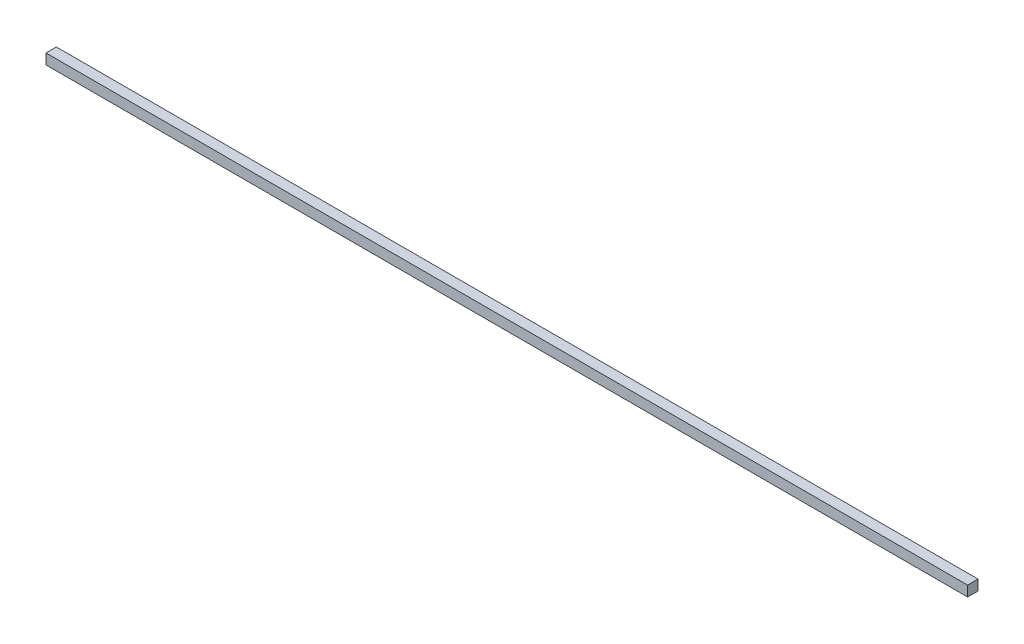
ISO-10303-21;
HEADER;
FILE_DESCRIPTION(('STEP AP214'),'2;1');
FILE_NAME('part.step','',(''),(''),'','','');
FILE_SCHEMA(('AUTOMOTIVE_DESIGN { 1 0 10303 214 1 1 1 1 }'));
ENDSEC;
DATA;
#1=APPLICATION_CONTEXT('core data for automotive mechanical design processes');
#2=APPLICATION_PROTOCOL_DEFINITION('international standard','automotive_design',2000,#1);
#3=PRODUCT_CONTEXT('',#1,'mechanical');
#4=PRODUCT('Part','Part','',(#3));
#5=PRODUCT_RELATED_PRODUCT_CATEGORY('part','',(#4));
#6=PRODUCT_DEFINITION_FORMATION('','',#4);
#7=PRODUCT_DEFINITION_CONTEXT('part definition',#1,'design');
#8=PRODUCT_DEFINITION('design','',#6,#7);
#9=PRODUCT_DEFINITION_SHAPE('','',#8);
#10=(LENGTH_UNIT() NAMED_UNIT(*) SI_UNIT(.MILLI.,.METRE.));
#11=(NAMED_UNIT(*) PLANE_ANGLE_UNIT() SI_UNIT($,.RADIAN.));
#12=(NAMED_UNIT(*) SI_UNIT($,.STERADIAN.) SOLID_ANGLE_UNIT());
#13=UNCERTAINTY_MEASURE_WITH_UNIT(LENGTH_MEASURE(1.E-05),#10,'distance_accuracy_value','');
#14=(GEOMETRIC_REPRESENTATION_CONTEXT(3) GLOBAL_UNCERTAINTY_ASSIGNED_CONTEXT((#13)) GLOBAL_UNIT_ASSIGNED_CONTEXT((#10,
#11,#12)) REPRESENTATION_CONTEXT('',''));
#15=CARTESIAN_POINT('',(0.,0.,0.));
#16=DIRECTION('',(0.,0.,1.));
#17=DIRECTION('',(1.,0.,0.));
#18=AXIS2_PLACEMENT_3D('',#15,#16,#17);
#19=CARTESIAN_POINT('',(-444.265,10.,-5.));
#20=DIRECTION('',(1.,0.,0.));
#21=DIRECTION('',(0.,0.,-1.));
#22=AXIS2_PLACEMENT_3D('',#19,#20,#21);
#23=PLANE('',#22);
#24=DIRECTION('',(0.,0.,1.));
#25=VECTOR('',#24,1.);
#26=CARTESIAN_POINT('',(-444.265,0.,-5.));
#27=LINE('',#26,#25);
#28=CARTESIAN_POINT('',(-444.265,0.,-5.));
#29=VERTEX_POINT('',#28);
#30=CARTESIAN_POINT('',(-444.265,0.,5.));
#31=VERTEX_POINT('',#30);
#32=EDGE_CURVE('E97',#29,#31,#27,.T.);
#33=ORIENTED_EDGE('',*,*,#32,.T.);
#34=DIRECTION('',(0.,-1.,0.));
#35=VECTOR('',#34,1.);
#36=CARTESIAN_POINT('',(-444.265,10.,5.));
#37=LINE('',#36,#35);
#38=CARTESIAN_POINT('',(-444.265,10.,5.));
#39=VERTEX_POINT('',#38);
#40=EDGE_CURVE('E11',#39,#31,#37,.T.);
#41=ORIENTED_EDGE('',*,*,#40,.F.);
#42=DIRECTION('',(0.,0.,1.));
#43=VECTOR('',#42,1.);
#44=CARTESIAN_POINT('',(-444.265,10.,-5.));
#45=LINE('',#44,#43);
#46=CARTESIAN_POINT('',(-444.265,10.,-5.));
#47=VERTEX_POINT('',#46);
#48=EDGE_CURVE('E85',#47,#39,#45,.T.);
#49=ORIENTED_EDGE('',*,*,#48,.F.);
#50=DIRECTION('',(0.,-1.,0.));
#51=VECTOR('',#50,1.);
#52=CARTESIAN_POINT('',(-444.265,10.,-5.));
#53=LINE('',#52,#51);
#54=EDGE_CURVE('E93',#47,#29,#53,.T.);
#55=ORIENTED_EDGE('',*,*,#54,.T.);
#56=EDGE_LOOP('',(#33,#41,#49,#55));
#57=FACE_BOUND('',#56,.T.);
#58=ADVANCED_FACE('F34',(#57),#23,.F.);
#59=CARTESIAN_POINT('',(-444.265,10.,5.));
#60=DIRECTION('',(0.,0.,-1.));
#61=DIRECTION('',(-1.,0.,0.));
#62=AXIS2_PLACEMENT_3D('',#59,#60,#61);
#63=PLANE('',#62);
#64=DIRECTION('',(1.,0.,0.));
#65=VECTOR('',#64,1.);
#66=CARTESIAN_POINT('',(-444.265,0.,5.));
#67=LINE('',#66,#65);
#68=CARTESIAN_POINT('',(444.265,0.,5.));
#69=VERTEX_POINT('',#68);
#70=EDGE_CURVE('E89',#31,#69,#67,.T.);
#71=ORIENTED_EDGE('',*,*,#70,.T.);
#72=DIRECTION('',(0.,-1.,0.));
#73=VECTOR('',#72,1.);
#74=CARTESIAN_POINT('',(444.265,10.,5.));
#75=LINE('',#74,#73);
#76=CARTESIAN_POINT('',(444.265,10.,5.));
#77=VERTEX_POINT('',#76);
#78=EDGE_CURVE('E42',#77,#69,#75,.T.);
#79=ORIENTED_EDGE('',*,*,#78,.F.);
#80=DIRECTION('',(1.,0.,0.));
#81=VECTOR('',#80,1.);
#82=CARTESIAN_POINT('',(-444.265,10.,5.));
#83=LINE('',#82,#81);
#84=EDGE_CURVE('E80',#39,#77,#83,.T.);
#85=ORIENTED_EDGE('',*,*,#84,.F.);
#86=ORIENTED_EDGE('',*,*,#40,.T.);
#87=EDGE_LOOP('',(#71,#79,#85,#86));
#88=FACE_BOUND('',#87,.T.);
#89=ADVANCED_FACE('F88',(#88),#63,.F.);
#90=CARTESIAN_POINT('',(444.265,10.,-5.));
#91=DIRECTION('',(-1.,0.,0.));
#92=DIRECTION('',(0.,0.,1.));
#93=AXIS2_PLACEMENT_3D('',#90,#91,#92);
#94=PLANE('',#93);
#95=DIRECTION('',(0.,0.,-1.));
#96=VECTOR('',#95,1.);
#97=CARTESIAN_POINT('',(444.265,0.,-5.));
#98=LINE('',#97,#96);
#99=CARTESIAN_POINT('',(444.265,0.,-5.));
#100=VERTEX_POINT('',#99);
#101=EDGE_CURVE('E67',#69,#100,#98,.T.);
#102=ORIENTED_EDGE('',*,*,#101,.T.);
#103=DIRECTION('',(0.,-1.,0.));
#104=VECTOR('',#103,1.);
#105=CARTESIAN_POINT('',(444.265,10.,-5.));
#106=LINE('',#105,#104);
#107=CARTESIAN_POINT('',(444.265,10.,-5.));
#108=VERTEX_POINT('',#107);
#109=EDGE_CURVE('E90',#108,#100,#106,.T.);
#110=ORIENTED_EDGE('',*,*,#109,.F.);
#111=DIRECTION('',(0.,0.,-1.));
#112=VECTOR('',#111,1.);
#113=CARTESIAN_POINT('',(444.265,10.,-5.));
#114=LINE('',#113,#112);
#115=EDGE_CURVE('E83',#77,#108,#114,.T.);
#116=ORIENTED_EDGE('',*,*,#115,.F.);
#117=ORIENTED_EDGE('',*,*,#78,.T.);
#118=EDGE_LOOP('',(#102,#110,#116,#117));
#119=FACE_BOUND('',#118,.T.);
#120=ADVANCED_FACE('F91',(#119),#94,.F.);
#121=CARTESIAN_POINT('',(-444.265,10.,-5.));
#122=DIRECTION('',(0.,0.,1.));
#123=DIRECTION('',(1.,0.,0.));
#124=AXIS2_PLACEMENT_3D('',#121,#122,#123);
#125=PLANE('',#124);
#126=DIRECTION('',(-1.,0.,0.));
#127=VECTOR('',#126,1.);
#128=CARTESIAN_POINT('',(-444.265,0.,-5.));
#129=LINE('',#128,#127);
#130=EDGE_CURVE('E73',#100,#29,#129,.T.);
#131=ORIENTED_EDGE('',*,*,#130,.T.);
#132=ORIENTED_EDGE('',*,*,#54,.F.);
#133=DIRECTION('',(-1.,0.,0.));
#134=VECTOR('',#133,1.);
#135=CARTESIAN_POINT('',(-444.265,10.,-5.));
#136=LINE('',#135,#134);
#137=EDGE_CURVE('E50',#108,#47,#136,.T.);
#138=ORIENTED_EDGE('',*,*,#137,.F.);
#139=ORIENTED_EDGE('',*,*,#109,.T.);
#140=EDGE_LOOP('',(#131,#132,#138,#139));
#141=FACE_BOUND('',#140,.T.);
#142=ADVANCED_FACE('F104',(#141),#125,.F.);
#143=CARTESIAN_POINT('',(0.,10.,0.));
#144=DIRECTION('',(0.,1.,0.));
#145=DIRECTION('',(0.,0.,1.));
#146=AXIS2_PLACEMENT_3D('',#143,#144,#145);
#147=PLANE('',#146);
#148=ORIENTED_EDGE('',*,*,#48,.T.);
#149=ORIENTED_EDGE('',*,*,#84,.T.);
#150=ORIENTED_EDGE('',*,*,#115,.T.);
#151=ORIENTED_EDGE('',*,*,#137,.T.);
#152=EDGE_LOOP('',(#148,#149,#150,#151));
#153=FACE_BOUND('',#152,.T.);
#154=ADVANCED_FACE('F81',(#153),#147,.T.);
#155=CARTESIAN_POINT('',(0.,0.,0.));
#156=DIRECTION('',(0.,1.,0.));
#157=DIRECTION('',(0.,0.,1.));
#158=AXIS2_PLACEMENT_3D('',#155,#156,#157);
#159=PLANE('',#158);
#160=ORIENTED_EDGE('',*,*,#32,.F.);
#161=ORIENTED_EDGE('',*,*,#130,.F.);
#162=ORIENTED_EDGE('',*,*,#101,.F.);
#163=ORIENTED_EDGE('',*,*,#70,.F.);
#164=EDGE_LOOP('',(#160,#161,#162,#163));
#165=FACE_BOUND('',#164,.T.);
#166=ADVANCED_FACE('F107',(#165),#159,.F.);
#167=CLOSED_SHELL('',(#58,#89,#120,#142,#154,#166));
#168=MANIFOLD_SOLID_BREP('B2',#167);
#169=ADVANCED_BREP_SHAPE_REPRESENTATION('',(#18,#168),#14);
#170=SHAPE_DEFINITION_REPRESENTATION(#9,#169);
ENDSEC;
END-ISO-10303-21;
